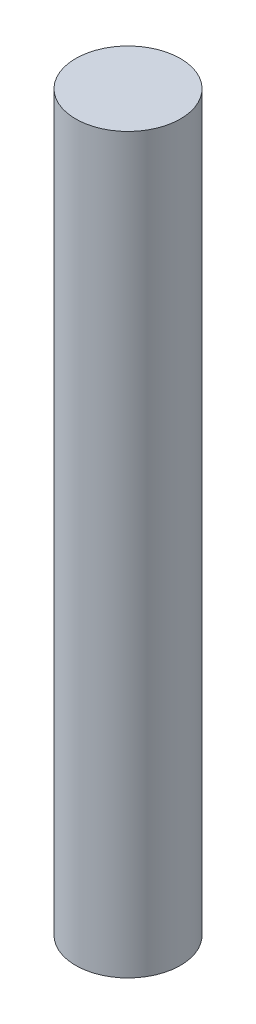
ISO-10303-21;
HEADER;
FILE_DESCRIPTION(('STEP AP214'),'2;1');
FILE_NAME('part.step','',(''),(''),'','','');
FILE_SCHEMA(('AUTOMOTIVE_DESIGN { 1 0 10303 214 1 1 1 1 }'));
ENDSEC;
DATA;
#1=APPLICATION_CONTEXT('core data for automotive mechanical design processes');
#2=APPLICATION_PROTOCOL_DEFINITION('international standard','automotive_design',2000,#1);
#3=PRODUCT_CONTEXT('',#1,'mechanical');
#4=PRODUCT('Part','Part','',(#3));
#5=PRODUCT_RELATED_PRODUCT_CATEGORY('part','',(#4));
#6=PRODUCT_DEFINITION_FORMATION('','',#4);
#7=PRODUCT_DEFINITION_CONTEXT('part definition',#1,'design');
#8=PRODUCT_DEFINITION('design','',#6,#7);
#9=PRODUCT_DEFINITION_SHAPE('','',#8);
#10=(LENGTH_UNIT() NAMED_UNIT(*) SI_UNIT(.MILLI.,.METRE.));
#11=(NAMED_UNIT(*) PLANE_ANGLE_UNIT() SI_UNIT($,.RADIAN.));
#12=(NAMED_UNIT(*) SI_UNIT($,.STERADIAN.) SOLID_ANGLE_UNIT());
#13=UNCERTAINTY_MEASURE_WITH_UNIT(LENGTH_MEASURE(1.E-05),#10,'distance_accuracy_value','');
#14=(GEOMETRIC_REPRESENTATION_CONTEXT(3) GLOBAL_UNCERTAINTY_ASSIGNED_CONTEXT((#13)) GLOBAL_UNIT_ASSIGNED_CONTEXT((#10,
#11,#12)) REPRESENTATION_CONTEXT('',''));
#15=CARTESIAN_POINT('',(0.,0.,0.));
#16=DIRECTION('',(0.,0.,1.));
#17=DIRECTION('',(1.,0.,0.));
#18=AXIS2_PLACEMENT_3D('',#15,#16,#17);
#19=CARTESIAN_POINT('',(0.,105.,0.));
#20=DIRECTION('',(0.,1.,0.));
#21=DIRECTION('',(0.,0.,1.));
#22=AXIS2_PLACEMENT_3D('',#19,#20,#21);
#23=PLANE('',#22);
#24=CARTESIAN_POINT('',(0.,105.,0.));
#25=DIRECTION('',(0.,-1.,0.));
#26=DIRECTION('',(0.,0.,-1.));
#27=AXIS2_PLACEMENT_3D('',#24,#25,#26);
#28=CIRCLE('',#27,7.5);
#29=CARTESIAN_POINT('',(0.,105.,-7.5));
#30=VERTEX_POINT('',#29);
#31=EDGE_CURVE('E10',#30,#30,#28,.T.);
#32=ORIENTED_EDGE('',*,*,#31,.F.);
#33=EDGE_LOOP('',(#32));
#34=FACE_BOUND('',#33,.T.);
#35=ADVANCED_FACE('F33',(#34),#23,.T.);
#36=CARTESIAN_POINT('',(0.,0.,0.));
#37=DIRECTION('',(0.,-1.,0.));
#38=DIRECTION('',(0.,0.,-1.));
#39=AXIS2_PLACEMENT_3D('',#36,#37,#38);
#40=CYLINDRICAL_SURFACE('',#39,7.5);
#41=ORIENTED_EDGE('',*,*,#31,.T.);
#42=EDGE_LOOP('',(#41));
#43=FACE_BOUND('',#42,.T.);
#44=CARTESIAN_POINT('',(0.,0.,0.));
#45=DIRECTION('',(0.,-1.,0.));
#46=DIRECTION('',(0.,0.,-1.));
#47=AXIS2_PLACEMENT_3D('',#44,#45,#46);
#48=CIRCLE('',#47,7.5);
#49=CARTESIAN_POINT('',(0.,0.,-7.5));
#50=VERTEX_POINT('',#49);
#51=EDGE_CURVE('E39',#50,#50,#48,.T.);
#52=ORIENTED_EDGE('',*,*,#51,.F.);
#53=EDGE_LOOP('',(#52));
#54=FACE_BOUND('',#53,.T.);
#55=ADVANCED_FACE('F47',(#43,#54),#40,.T.);
#56=CARTESIAN_POINT('',(0.,0.,0.));
#57=DIRECTION('',(0.,-1.,0.));
#58=DIRECTION('',(0.,0.,-1.));
#59=AXIS2_PLACEMENT_3D('',#56,#57,#58);
#60=PLANE('',#59);
#61=ORIENTED_EDGE('',*,*,#51,.T.);
#62=EDGE_LOOP('',(#61));
#63=FACE_BOUND('',#62,.T.);
#64=ADVANCED_FACE('F45',(#63),#60,.T.);
#65=CLOSED_SHELL('',(#35,#55,#64));
#66=MANIFOLD_SOLID_BREP('B2',#65);
#67=ADVANCED_BREP_SHAPE_REPRESENTATION('',(#18,#66),#14);
#68=SHAPE_DEFINITION_REPRESENTATION(#9,#67);
ENDSEC;
END-ISO-10303-21;
